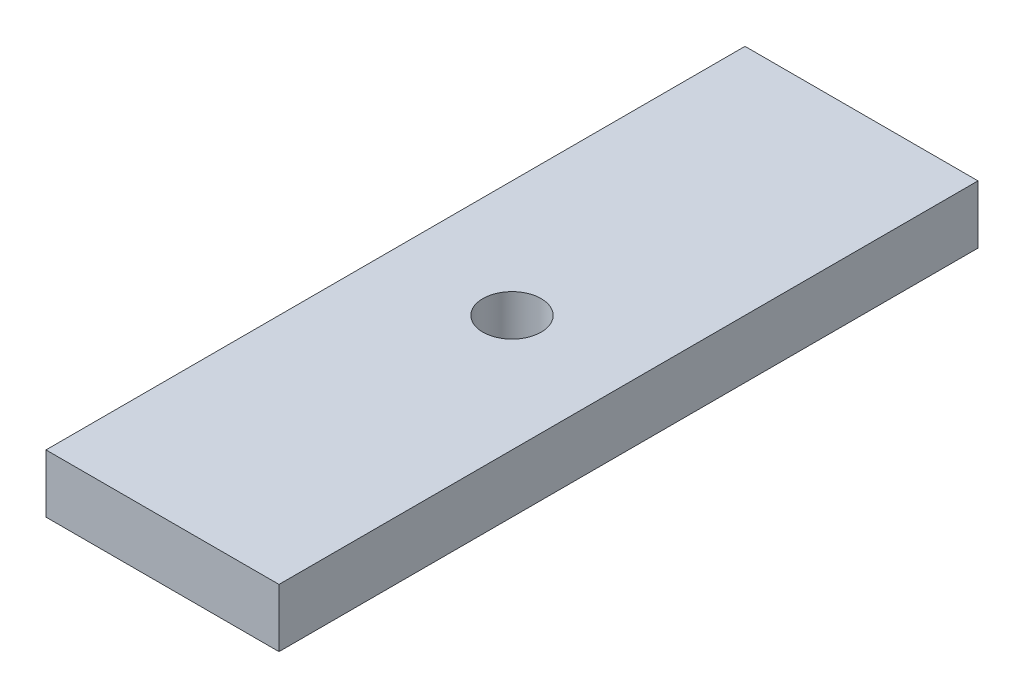
ISO-10303-21;
HEADER;
FILE_DESCRIPTION(('STEP AP214'),'2;1');
FILE_NAME('part.step','',(''),(''),'','','');
FILE_SCHEMA(('AUTOMOTIVE_DESIGN { 1 0 10303 214 1 1 1 1 }'));
ENDSEC;
DATA;
#1=APPLICATION_CONTEXT('core data for automotive mechanical design processes');
#2=APPLICATION_PROTOCOL_DEFINITION('international standard','automotive_design',2000,#1);
#3=PRODUCT_CONTEXT('',#1,'mechanical');
#4=PRODUCT('Part','Part','',(#3));
#5=PRODUCT_RELATED_PRODUCT_CATEGORY('part','',(#4));
#6=PRODUCT_DEFINITION_FORMATION('','',#4);
#7=PRODUCT_DEFINITION_CONTEXT('part definition',#1,'design');
#8=PRODUCT_DEFINITION('design','',#6,#7);
#9=PRODUCT_DEFINITION_SHAPE('','',#8);
#10=(LENGTH_UNIT() NAMED_UNIT(*) SI_UNIT(.MILLI.,.METRE.));
#11=(NAMED_UNIT(*) PLANE_ANGLE_UNIT() SI_UNIT($,.RADIAN.));
#12=(NAMED_UNIT(*) SI_UNIT($,.STERADIAN.) SOLID_ANGLE_UNIT());
#13=UNCERTAINTY_MEASURE_WITH_UNIT(LENGTH_MEASURE(1.E-05),#10,'distance_accuracy_value','');
#14=(GEOMETRIC_REPRESENTATION_CONTEXT(3) GLOBAL_UNCERTAINTY_ASSIGNED_CONTEXT((#13)) GLOBAL_UNIT_ASSIGNED_CONTEXT((#10,
#11,#12)) REPRESENTATION_CONTEXT('',''));
#15=CARTESIAN_POINT('',(0.,0.,0.));
#16=DIRECTION('',(0.,0.,1.));
#17=DIRECTION('',(1.,0.,0.));
#18=AXIS2_PLACEMENT_3D('',#15,#16,#17);
#19=CARTESIAN_POINT('',(0.,10.,0.));
#20=DIRECTION('',(0.,0.,-1.));
#21=DIRECTION('',(-1.,0.,0.));
#22=AXIS2_PLACEMENT_3D('',#19,#20,#21);
#23=PLANE('',#22);
#24=DIRECTION('',(1.,0.,0.));
#25=VECTOR('',#24,1.);
#26=CARTESIAN_POINT('',(0.,0.,0.));
#27=LINE('',#26,#25);
#28=CARTESIAN_POINT('',(0.,0.,0.));
#29=VERTEX_POINT('',#28);
#30=CARTESIAN_POINT('',(40.,0.,0.));
#31=VERTEX_POINT('',#30);
#32=EDGE_CURVE('E102',#29,#31,#27,.T.);
#33=ORIENTED_EDGE('',*,*,#32,.T.);
#34=DIRECTION('',(0.,-1.,0.));
#35=VECTOR('',#34,1.);
#36=CARTESIAN_POINT('',(40.,10.,0.));
#37=LINE('',#36,#35);
#38=CARTESIAN_POINT('',(40.,10.,0.));
#39=VERTEX_POINT('',#38);
#40=EDGE_CURVE('E11',#39,#31,#37,.T.);
#41=ORIENTED_EDGE('',*,*,#40,.F.);
#42=DIRECTION('',(1.,0.,0.));
#43=VECTOR('',#42,1.);
#44=CARTESIAN_POINT('',(0.,10.,0.));
#45=LINE('',#44,#43);
#46=CARTESIAN_POINT('',(0.,10.,0.));
#47=VERTEX_POINT('',#46);
#48=EDGE_CURVE('E87',#47,#39,#45,.T.);
#49=ORIENTED_EDGE('',*,*,#48,.F.);
#50=DIRECTION('',(0.,-1.,0.));
#51=VECTOR('',#50,1.);
#52=CARTESIAN_POINT('',(0.,10.,0.));
#53=LINE('',#52,#51);
#54=EDGE_CURVE('E101',#47,#29,#53,.T.);
#55=ORIENTED_EDGE('',*,*,#54,.T.);
#56=EDGE_LOOP('',(#33,#41,#49,#55));
#57=FACE_BOUND('',#56,.T.);
#58=ADVANCED_FACE('F35',(#57),#23,.F.);
#59=CARTESIAN_POINT('',(40.,10.,0.));
#60=DIRECTION('',(-1.,0.,0.));
#61=DIRECTION('',(0.,0.,1.));
#62=AXIS2_PLACEMENT_3D('',#59,#60,#61);
#63=PLANE('',#62);
#64=DIRECTION('',(0.,0.,-1.));
#65=VECTOR('',#64,1.);
#66=CARTESIAN_POINT('',(40.,0.,0.));
#67=LINE('',#66,#65);
#68=CARTESIAN_POINT('',(40.,0.,-120.));
#69=VERTEX_POINT('',#68);
#70=EDGE_CURVE('E91',#31,#69,#67,.T.);
#71=ORIENTED_EDGE('',*,*,#70,.T.);
#72=DIRECTION('',(0.,-1.,0.));
#73=VECTOR('',#72,1.);
#74=CARTESIAN_POINT('',(40.,10.,-120.));
#75=LINE('',#74,#73);
#76=CARTESIAN_POINT('',(40.,10.,-120.));
#77=VERTEX_POINT('',#76);
#78=EDGE_CURVE('E43',#77,#69,#75,.T.);
#79=ORIENTED_EDGE('',*,*,#78,.F.);
#80=DIRECTION('',(0.,0.,-1.));
#81=VECTOR('',#80,1.);
#82=CARTESIAN_POINT('',(40.,10.,0.));
#83=LINE('',#82,#81);
#84=EDGE_CURVE('E81',#39,#77,#83,.T.);
#85=ORIENTED_EDGE('',*,*,#84,.F.);
#86=ORIENTED_EDGE('',*,*,#40,.T.);
#87=EDGE_LOOP('',(#71,#79,#85,#86));
#88=FACE_BOUND('',#87,.T.);
#89=ADVANCED_FACE('F90',(#88),#63,.F.);
#90=CARTESIAN_POINT('',(0.,10.,-120.));
#91=DIRECTION('',(0.,0.,1.));
#92=DIRECTION('',(1.,0.,0.));
#93=AXIS2_PLACEMENT_3D('',#90,#91,#92);
#94=PLANE('',#93);
#95=DIRECTION('',(-1.,0.,0.));
#96=VECTOR('',#95,1.);
#97=CARTESIAN_POINT('',(0.,0.,-120.));
#98=LINE('',#97,#96);
#99=CARTESIAN_POINT('',(0.,0.,-120.));
#100=VERTEX_POINT('',#99);
#101=EDGE_CURVE('E68',#69,#100,#98,.T.);
#102=ORIENTED_EDGE('',*,*,#101,.T.);
#103=DIRECTION('',(0.,-1.,0.));
#104=VECTOR('',#103,1.);
#105=CARTESIAN_POINT('',(0.,10.,-120.));
#106=LINE('',#105,#104);
#107=CARTESIAN_POINT('',(0.,10.,-120.));
#108=VERTEX_POINT('',#107);
#109=EDGE_CURVE('E92',#108,#100,#106,.T.);
#110=ORIENTED_EDGE('',*,*,#109,.F.);
#111=DIRECTION('',(-1.,0.,0.));
#112=VECTOR('',#111,1.);
#113=CARTESIAN_POINT('',(0.,10.,-120.));
#114=LINE('',#113,#112);
#115=EDGE_CURVE('E85',#77,#108,#114,.T.);
#116=ORIENTED_EDGE('',*,*,#115,.F.);
#117=ORIENTED_EDGE('',*,*,#78,.T.);
#118=EDGE_LOOP('',(#102,#110,#116,#117));
#119=FACE_BOUND('',#118,.T.);
#120=ADVANCED_FACE('F93',(#119),#94,.F.);
#121=CARTESIAN_POINT('',(0.,10.,0.));
#122=DIRECTION('',(1.,0.,0.));
#123=DIRECTION('',(0.,0.,-1.));
#124=AXIS2_PLACEMENT_3D('',#121,#122,#123);
#125=PLANE('',#124);
#126=DIRECTION('',(0.,0.,1.));
#127=VECTOR('',#126,1.);
#128=CARTESIAN_POINT('',(0.,0.,0.));
#129=LINE('',#128,#127);
#130=EDGE_CURVE('E74',#100,#29,#129,.T.);
#131=ORIENTED_EDGE('',*,*,#130,.T.);
#132=ORIENTED_EDGE('',*,*,#54,.F.);
#133=DIRECTION('',(0.,0.,1.));
#134=VECTOR('',#133,1.);
#135=CARTESIAN_POINT('',(0.,10.,0.));
#136=LINE('',#135,#134);
#137=EDGE_CURVE('E51',#108,#47,#136,.T.);
#138=ORIENTED_EDGE('',*,*,#137,.F.);
#139=ORIENTED_EDGE('',*,*,#109,.T.);
#140=EDGE_LOOP('',(#131,#132,#138,#139));
#141=FACE_BOUND('',#140,.T.);
#142=ADVANCED_FACE('F112',(#141),#125,.F.);
#143=CARTESIAN_POINT('',(20.,10.,-60.));
#144=DIRECTION('',(0.,-1.,0.));
#145=DIRECTION('',(0.,0.,-1.));
#146=AXIS2_PLACEMENT_3D('',#143,#144,#145);
#147=CYLINDRICAL_SURFACE('',#146,5.);
#148=CARTESIAN_POINT('',(20.,10.,-60.));
#149=DIRECTION('',(0.,1.,0.));
#150=DIRECTION('',(0.,0.,1.));
#151=AXIS2_PLACEMENT_3D('',#148,#149,#150);
#152=CIRCLE('',#151,5.);
#153=CARTESIAN_POINT('',(20.,10.,-55.));
#154=VERTEX_POINT('',#153);
#155=EDGE_CURVE('E95',#154,#154,#152,.T.);
#156=ORIENTED_EDGE('',*,*,#155,.T.);
#157=EDGE_LOOP('',(#156));
#158=FACE_BOUND('',#157,.T.);
#159=CARTESIAN_POINT('',(20.,0.,-60.));
#160=DIRECTION('',(0.,1.,0.));
#161=DIRECTION('',(0.,0.,1.));
#162=AXIS2_PLACEMENT_3D('',#159,#160,#161);
#163=CIRCLE('',#162,5.);
#164=CARTESIAN_POINT('',(20.,0.,-55.));
#165=VERTEX_POINT('',#164);
#166=EDGE_CURVE('E108',#165,#165,#163,.T.);
#167=ORIENTED_EDGE('',*,*,#166,.F.);
#168=EDGE_LOOP('',(#167));
#169=FACE_BOUND('',#168,.T.);
#170=ADVANCED_FACE('F129',(#158,#169),#147,.F.);
#171=CARTESIAN_POINT('',(0.,10.,0.));
#172=DIRECTION('',(0.,1.,0.));
#173=DIRECTION('',(0.,0.,1.));
#174=AXIS2_PLACEMENT_3D('',#171,#172,#173);
#175=PLANE('',#174);
#176=ORIENTED_EDGE('',*,*,#48,.T.);
#177=ORIENTED_EDGE('',*,*,#84,.T.);
#178=ORIENTED_EDGE('',*,*,#115,.T.);
#179=ORIENTED_EDGE('',*,*,#137,.T.);
#180=EDGE_LOOP('',(#176,#177,#178,#179));
#181=FACE_BOUND('',#180,.T.);
#182=ORIENTED_EDGE('',*,*,#155,.F.);
#183=EDGE_LOOP('',(#182));
#184=FACE_BOUND('',#183,.T.);
#185=ADVANCED_FACE('F82',(#181,#184),#175,.T.);
#186=CARTESIAN_POINT('',(0.,0.,0.));
#187=DIRECTION('',(0.,1.,0.));
#188=DIRECTION('',(0.,0.,1.));
#189=AXIS2_PLACEMENT_3D('',#186,#187,#188);
#190=PLANE('',#189);
#191=ORIENTED_EDGE('',*,*,#32,.F.);
#192=ORIENTED_EDGE('',*,*,#130,.F.);
#193=ORIENTED_EDGE('',*,*,#101,.F.);
#194=ORIENTED_EDGE('',*,*,#70,.F.);
#195=EDGE_LOOP('',(#191,#192,#193,#194));
#196=FACE_BOUND('',#195,.T.);
#197=ORIENTED_EDGE('',*,*,#166,.T.);
#198=EDGE_LOOP('',(#197));
#199=FACE_BOUND('',#198,.T.);
#200=ADVANCED_FACE('F115',(#196,#199),#190,.F.);
#201=CLOSED_SHELL('',(#58,#89,#120,#142,#170,#185,#200));
#202=MANIFOLD_SOLID_BREP('B2',#201);
#203=ADVANCED_BREP_SHAPE_REPRESENTATION('',(#18,#202),#14);
#204=SHAPE_DEFINITION_REPRESENTATION(#9,#203);
ENDSEC;
END-ISO-10303-21;
